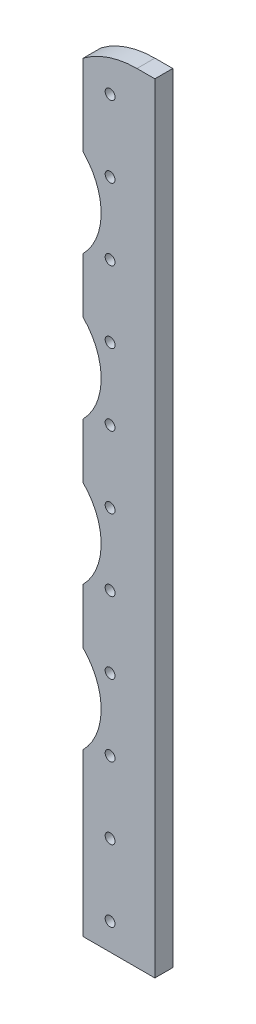
ISO-10303-21;
HEADER;
FILE_DESCRIPTION(('STEP AP214'),'2;1');
FILE_NAME('part.step','',(''),(''),'','','');
FILE_SCHEMA(('AUTOMOTIVE_DESIGN { 1 0 10303 214 1 1 1 1 }'));
ENDSEC;
DATA;
#1=APPLICATION_CONTEXT('core data for automotive mechanical design processes');
#2=APPLICATION_PROTOCOL_DEFINITION('international standard','automotive_design',2000,#1);
#3=PRODUCT_CONTEXT('',#1,'mechanical');
#4=PRODUCT('Part','Part','',(#3));
#5=PRODUCT_RELATED_PRODUCT_CATEGORY('part','',(#4));
#6=PRODUCT_DEFINITION_FORMATION('','',#4);
#7=PRODUCT_DEFINITION_CONTEXT('part definition',#1,'design');
#8=PRODUCT_DEFINITION('design','',#6,#7);
#9=PRODUCT_DEFINITION_SHAPE('','',#8);
#10=(LENGTH_UNIT() NAMED_UNIT(*) SI_UNIT(.MILLI.,.METRE.));
#11=(NAMED_UNIT(*) PLANE_ANGLE_UNIT() SI_UNIT($,.RADIAN.));
#12=(NAMED_UNIT(*) SI_UNIT($,.STERADIAN.) SOLID_ANGLE_UNIT());
#13=UNCERTAINTY_MEASURE_WITH_UNIT(LENGTH_MEASURE(1.E-05),#10,'distance_accuracy_value','');
#14=(GEOMETRIC_REPRESENTATION_CONTEXT(3) GLOBAL_UNCERTAINTY_ASSIGNED_CONTEXT((#13)) GLOBAL_UNIT_ASSIGNED_CONTEXT((#10,
#11,#12)) REPRESENTATION_CONTEXT('',''));
#15=CARTESIAN_POINT('',(0.,0.,0.));
#16=DIRECTION('',(0.,0.,1.));
#17=DIRECTION('',(1.,0.,0.));
#18=AXIS2_PLACEMENT_3D('',#15,#16,#17);
#19=CARTESIAN_POINT('',(-25.4,0.,6.35));
#20=DIRECTION('',(1.,0.,0.));
#21=DIRECTION('',(0.,0.,-1.));
#22=AXIS2_PLACEMENT_3D('',#19,#20,#21);
#23=PLANE('',#22);
#24=DIRECTION('',(0.,-1.,0.));
#25=VECTOR('',#24,1.);
#26=CARTESIAN_POINT('',(-25.4,0.,0.));
#27=LINE('',#26,#25);
#28=CARTESIAN_POINT('',(-25.4,108.270740133327,0.));
#29=VERTEX_POINT('',#28);
#30=CARTESIAN_POINT('',(-25.4,88.5792598666732,0.));
#31=VERTEX_POINT('',#30);
#32=EDGE_CURVE('E148',#29,#31,#27,.T.);
#33=ORIENTED_EDGE('',*,*,#32,.T.);
#34=DIRECTION('',(0.,0.,1.));
#35=VECTOR('',#34,1.);
#36=CARTESIAN_POINT('',(-25.4,88.5792598666732,0.));
#37=LINE('',#36,#35);
#38=CARTESIAN_POINT('',(-25.4,88.5792598666732,6.35));
#39=VERTEX_POINT('',#38);
#40=EDGE_CURVE('E50',#31,#39,#37,.T.);
#41=ORIENTED_EDGE('',*,*,#40,.T.);
#42=DIRECTION('',(0.,-1.,0.));
#43=VECTOR('',#42,1.);
#44=CARTESIAN_POINT('',(-25.4,0.,6.35));
#45=LINE('',#44,#43);
#46=CARTESIAN_POINT('',(-25.4,108.270740133327,6.35));
#47=VERTEX_POINT('',#46);
#48=EDGE_CURVE('E274',#47,#39,#45,.T.);
#49=ORIENTED_EDGE('',*,*,#48,.F.);
#50=DIRECTION('',(0.,0.,1.));
#51=VECTOR('',#50,1.);
#52=CARTESIAN_POINT('',(-25.4,108.270740133327,0.));
#53=LINE('',#52,#51);
#54=EDGE_CURVE('E548',#47,#29,#53,.F.);
#55=ORIENTED_EDGE('',*,*,#54,.T.);
#56=EDGE_LOOP('',(#33,#41,#49,#55));
#57=FACE_BOUND('',#56,.T.);
#58=ADVANCED_FACE('F35',(#57),#23,.F.);
#59=CARTESIAN_POINT('',(-25.4,159.070740133327,0.));
#60=VERTEX_POINT('',#59);
#61=CARTESIAN_POINT('',(-25.4,139.379259866673,0.));
#62=VERTEX_POINT('',#61);
#63=EDGE_CURVE('E152',#60,#62,#27,.T.);
#64=ORIENTED_EDGE('',*,*,#63,.T.);
#65=DIRECTION('',(0.,0.,1.));
#66=VECTOR('',#65,1.);
#67=CARTESIAN_POINT('',(-25.4,139.379259866673,0.));
#68=LINE('',#67,#66);
#69=CARTESIAN_POINT('',(-25.4,139.379259866673,6.35));
#70=VERTEX_POINT('',#69);
#71=EDGE_CURVE('E57',#62,#70,#68,.T.);
#72=ORIENTED_EDGE('',*,*,#71,.T.);
#73=CARTESIAN_POINT('',(-25.4,159.070740133327,6.35));
#74=VERTEX_POINT('',#73);
#75=EDGE_CURVE('E276',#74,#70,#45,.T.);
#76=ORIENTED_EDGE('',*,*,#75,.F.);
#77=DIRECTION('',(0.,0.,1.));
#78=VECTOR('',#77,1.);
#79=CARTESIAN_POINT('',(-25.4,159.070740133327,0.));
#80=LINE('',#79,#78);
#81=EDGE_CURVE('E176',#74,#60,#80,.F.);
#82=ORIENTED_EDGE('',*,*,#81,.T.);
#83=EDGE_LOOP('',(#64,#72,#76,#82));
#84=FACE_BOUND('',#83,.T.);
#85=ADVANCED_FACE('F173',(#84),#23,.F.);
#86=CARTESIAN_POINT('',(-25.4,209.870740133327,0.));
#87=VERTEX_POINT('',#86);
#88=CARTESIAN_POINT('',(-25.4,190.179259866673,0.));
#89=VERTEX_POINT('',#88);
#90=EDGE_CURVE('E158',#87,#89,#27,.T.);
#91=ORIENTED_EDGE('',*,*,#90,.T.);
#92=DIRECTION('',(0.,0.,1.));
#93=VECTOR('',#92,1.);
#94=CARTESIAN_POINT('',(-25.4,190.179259866673,0.));
#95=LINE('',#94,#93);
#96=CARTESIAN_POINT('',(-25.4,190.179259866673,6.35));
#97=VERTEX_POINT('',#96);
#98=EDGE_CURVE('E289',#89,#97,#95,.T.);
#99=ORIENTED_EDGE('',*,*,#98,.T.);
#100=CARTESIAN_POINT('',(-25.4,209.870740133327,6.35));
#101=VERTEX_POINT('',#100);
#102=EDGE_CURVE('E257',#101,#97,#45,.T.);
#103=ORIENTED_EDGE('',*,*,#102,.F.);
#104=DIRECTION('',(0.,0.,1.));
#105=VECTOR('',#104,1.);
#106=CARTESIAN_POINT('',(-25.4,209.870740133327,0.));
#107=LINE('',#106,#105);
#108=EDGE_CURVE('E288',#101,#87,#107,.F.);
#109=ORIENTED_EDGE('',*,*,#108,.T.);
#110=EDGE_LOOP('',(#91,#99,#103,#109));
#111=FACE_BOUND('',#110,.T.);
#112=ADVANCED_FACE('F287',(#111),#23,.F.);
#113=CARTESIAN_POINT('',(-25.4,269.875,0.));
#114=VERTEX_POINT('',#113);
#115=CARTESIAN_POINT('',(-25.4,240.979259866673,0.));
#116=VERTEX_POINT('',#115);
#117=EDGE_CURVE('E151',#114,#116,#27,.T.);
#118=ORIENTED_EDGE('',*,*,#117,.T.);
#119=DIRECTION('',(0.,0.,1.));
#120=VECTOR('',#119,1.);
#121=CARTESIAN_POINT('',(-25.4,240.979259866673,0.));
#122=LINE('',#121,#120);
#123=CARTESIAN_POINT('',(-25.4,240.979259866673,6.35));
#124=VERTEX_POINT('',#123);
#125=EDGE_CURVE('E297',#116,#124,#122,.T.);
#126=ORIENTED_EDGE('',*,*,#125,.T.);
#127=CARTESIAN_POINT('',(-25.4,269.875,6.35));
#128=VERTEX_POINT('',#127);
#129=EDGE_CURVE('E251',#128,#124,#45,.T.);
#130=ORIENTED_EDGE('',*,*,#129,.F.);
#131=DIRECTION('',(0.,0.,1.));
#132=VECTOR('',#131,1.);
#133=CARTESIAN_POINT('',(-25.4,269.875,0.));
#134=LINE('',#133,#132);
#135=EDGE_CURVE('E261',#114,#128,#134,.T.);
#136=ORIENTED_EDGE('',*,*,#135,.F.);
#137=EDGE_LOOP('',(#118,#126,#130,#136));
#138=FACE_BOUND('',#137,.T.);
#139=ADVANCED_FACE('F313',(#138),#23,.F.);
#140=CARTESIAN_POINT('',(-25.4,57.4707401333268,6.35));
#141=VERTEX_POINT('',#140);
#142=CARTESIAN_POINT('',(-25.4,0.,6.35));
#143=VERTEX_POINT('',#142);
#144=EDGE_CURVE('E140',#141,#143,#45,.T.);
#145=ORIENTED_EDGE('',*,*,#144,.F.);
#146=DIRECTION('',(0.,0.,1.));
#147=VECTOR('',#146,1.);
#148=CARTESIAN_POINT('',(-25.4,57.4707401333268,0.));
#149=LINE('',#148,#147);
#150=CARTESIAN_POINT('',(-25.4,57.4707401333268,0.));
#151=VERTEX_POINT('',#150);
#152=EDGE_CURVE('E128',#141,#151,#149,.F.);
#153=ORIENTED_EDGE('',*,*,#152,.T.);
#154=CARTESIAN_POINT('',(-25.4,0.,0.));
#155=VERTEX_POINT('',#154);
#156=EDGE_CURVE('E138',#151,#155,#27,.T.);
#157=ORIENTED_EDGE('',*,*,#156,.T.);
#158=DIRECTION('',(0.,0.,-1.));
#159=VECTOR('',#158,1.);
#160=CARTESIAN_POINT('',(-25.4,0.,6.35));
#161=LINE('',#160,#159);
#162=EDGE_CURVE('E242',#143,#155,#161,.T.);
#163=ORIENTED_EDGE('',*,*,#162,.F.);
#164=EDGE_LOOP('',(#145,#153,#157,#163));
#165=FACE_BOUND('',#164,.T.);
#166=ADVANCED_FACE('F136',(#165),#23,.F.);
#167=CARTESIAN_POINT('',(0.,0.,6.35));
#168=DIRECTION('',(0.,0.,1.));
#169=DIRECTION('',(1.,0.,0.));
#170=AXIS2_PLACEMENT_3D('',#167,#168,#169);
#171=PLANE('',#170);
#172=CARTESIAN_POINT('',(-41.275,73.025,6.35));
#173=DIRECTION('',(0.,0.,1.));
#174=DIRECTION('',(1.,0.,0.));
#175=AXIS2_PLACEMENT_3D('',#172,#173,#174);
#176=CIRCLE('',#175,22.225);
#177=EDGE_CURVE('E141',#141,#39,#176,.T.);
#178=ORIENTED_EDGE('',*,*,#177,.F.);
#179=ORIENTED_EDGE('',*,*,#144,.T.);
#180=DIRECTION('',(1.,0.,0.));
#181=VECTOR('',#180,1.);
#182=CARTESIAN_POINT('',(0.,0.,6.35));
#183=LINE('',#182,#181);
#184=CARTESIAN_POINT('',(0.,0.,6.35));
#185=VERTEX_POINT('',#184);
#186=EDGE_CURVE('E246',#143,#185,#183,.T.);
#187=ORIENTED_EDGE('',*,*,#186,.T.);
#188=DIRECTION('',(0.,1.,0.));
#189=VECTOR('',#188,1.);
#190=CARTESIAN_POINT('',(0.,0.,6.35));
#191=LINE('',#190,#189);
#192=CARTESIAN_POINT('',(0.,276.225,6.35));
#193=VERTEX_POINT('',#192);
#194=EDGE_CURVE('E163',#185,#193,#191,.T.);
#195=ORIENTED_EDGE('',*,*,#194,.T.);
#196=DIRECTION('',(-1.,0.,0.));
#197=VECTOR('',#196,1.);
#198=CARTESIAN_POINT('',(0.,276.225,6.35));
#199=LINE('',#198,#197);
#200=CARTESIAN_POINT('',(-6.35,276.225,6.35));
#201=VERTEX_POINT('',#200);
#202=EDGE_CURVE('E272',#193,#201,#199,.T.);
#203=ORIENTED_EDGE('',*,*,#202,.T.);
#204=CARTESIAN_POINT('',(-6.35,244.475,6.35));
#205=DIRECTION('',(0.,0.,1.));
#206=DIRECTION('',(1.,0.,0.));
#207=AXIS2_PLACEMENT_3D('',#204,#205,#206);
#208=CIRCLE('',#207,31.75);
#209=EDGE_CURVE('E309',#201,#128,#208,.T.);
#210=ORIENTED_EDGE('',*,*,#209,.T.);
#211=ORIENTED_EDGE('',*,*,#129,.T.);
#212=CARTESIAN_POINT('',(-41.275,225.425,6.35));
#213=DIRECTION('',(0.,0.,1.));
#214=DIRECTION('',(1.,0.,0.));
#215=AXIS2_PLACEMENT_3D('',#212,#213,#214);
#216=CIRCLE('',#215,22.225);
#217=EDGE_CURVE('E286',#101,#124,#216,.T.);
#218=ORIENTED_EDGE('',*,*,#217,.F.);
#219=ORIENTED_EDGE('',*,*,#102,.T.);
#220=CARTESIAN_POINT('',(-41.275,174.625,6.35));
#221=DIRECTION('',(0.,0.,1.));
#222=DIRECTION('',(1.,0.,0.));
#223=AXIS2_PLACEMENT_3D('',#220,#221,#222);
#224=CIRCLE('',#223,22.225);
#225=EDGE_CURVE('E285',#74,#97,#224,.T.);
#226=ORIENTED_EDGE('',*,*,#225,.F.);
#227=ORIENTED_EDGE('',*,*,#75,.T.);
#228=CARTESIAN_POINT('',(-41.275,123.825,6.35));
#229=DIRECTION('',(0.,0.,1.));
#230=DIRECTION('',(1.,0.,0.));
#231=AXIS2_PLACEMENT_3D('',#228,#229,#230);
#232=CIRCLE('',#231,22.225);
#233=EDGE_CURVE('E552',#47,#70,#232,.T.);
#234=ORIENTED_EDGE('',*,*,#233,.F.);
#235=ORIENTED_EDGE('',*,*,#48,.T.);
#236=EDGE_LOOP('',(#178,#179,#187,#195,#203,#210,#211,#218,#219,#226,#227,#234,#235));
#237=FACE_BOUND('',#236,.T.);
#238=CARTESIAN_POINT('',(-15.875,238.125,6.35));
#239=DIRECTION('',(0.,0.,1.));
#240=DIRECTION('',(1.,0.,0.));
#241=AXIS2_PLACEMENT_3D('',#238,#239,#240);
#242=CIRCLE('',#241,1.75);
#243=CARTESIAN_POINT('',(-14.125,238.125,6.35));
#244=VERTEX_POINT('',#243);
#245=EDGE_CURVE('E302',#244,#244,#242,.T.);
#246=ORIENTED_EDGE('',*,*,#245,.F.);
#247=EDGE_LOOP('',(#246));
#248=FACE_BOUND('',#247,.T.);
#249=CARTESIAN_POINT('',(-15.875,263.525,6.35));
#250=DIRECTION('',(0.,0.,1.));
#251=DIRECTION('',(1.,0.,0.));
#252=AXIS2_PLACEMENT_3D('',#249,#250,#251);
#253=CIRCLE('',#252,1.75);
#254=CARTESIAN_POINT('',(-14.125,263.525,6.35));
#255=VERTEX_POINT('',#254);
#256=EDGE_CURVE('E305',#255,#255,#253,.T.);
#257=ORIENTED_EDGE('',*,*,#256,.F.);
#258=EDGE_LOOP('',(#257));
#259=FACE_BOUND('',#258,.T.);
#260=CARTESIAN_POINT('',(-15.875,212.725,6.35));
#261=DIRECTION('',(0.,0.,1.));
#262=DIRECTION('',(1.,0.,0.));
#263=AXIS2_PLACEMENT_3D('',#260,#261,#262);
#264=CIRCLE('',#263,1.75);
#265=CARTESIAN_POINT('',(-14.125,212.725,6.35));
#266=VERTEX_POINT('',#265);
#267=EDGE_CURVE('E233',#266,#266,#264,.T.);
#268=ORIENTED_EDGE('',*,*,#267,.F.);
#269=EDGE_LOOP('',(#268));
#270=FACE_BOUND('',#269,.T.);
#271=CARTESIAN_POINT('',(-15.875,187.325,6.35));
#272=DIRECTION('',(0.,0.,1.));
#273=DIRECTION('',(1.,0.,0.));
#274=AXIS2_PLACEMENT_3D('',#271,#272,#273);
#275=CIRCLE('',#274,1.75);
#276=CARTESIAN_POINT('',(-14.125,187.325,6.35));
#277=VERTEX_POINT('',#276);
#278=EDGE_CURVE('E227',#277,#277,#275,.T.);
#279=ORIENTED_EDGE('',*,*,#278,.F.);
#280=EDGE_LOOP('',(#279));
#281=FACE_BOUND('',#280,.T.);
#282=CARTESIAN_POINT('',(-15.875,161.925,6.35));
#283=DIRECTION('',(0.,0.,1.));
#284=DIRECTION('',(1.,0.,0.));
#285=AXIS2_PLACEMENT_3D('',#282,#283,#284);
#286=CIRCLE('',#285,1.75);
#287=CARTESIAN_POINT('',(-14.125,161.925,6.35));
#288=VERTEX_POINT('',#287);
#289=EDGE_CURVE('E221',#288,#288,#286,.T.);
#290=ORIENTED_EDGE('',*,*,#289,.F.);
#291=EDGE_LOOP('',(#290));
#292=FACE_BOUND('',#291,.T.);
#293=CARTESIAN_POINT('',(-15.875,136.525,6.35));
#294=DIRECTION('',(0.,0.,1.));
#295=DIRECTION('',(1.,0.,0.));
#296=AXIS2_PLACEMENT_3D('',#293,#294,#295);
#297=CIRCLE('',#296,1.75);
#298=CARTESIAN_POINT('',(-14.125,136.525,6.35));
#299=VERTEX_POINT('',#298);
#300=EDGE_CURVE('E215',#299,#299,#297,.T.);
#301=ORIENTED_EDGE('',*,*,#300,.F.);
#302=EDGE_LOOP('',(#301));
#303=FACE_BOUND('',#302,.T.);
#304=CARTESIAN_POINT('',(-15.875,111.125,6.35));
#305=DIRECTION('',(0.,0.,1.));
#306=DIRECTION('',(1.,0.,0.));
#307=AXIS2_PLACEMENT_3D('',#304,#305,#306);
#308=CIRCLE('',#307,1.75);
#309=CARTESIAN_POINT('',(-14.125,111.125,6.35));
#310=VERTEX_POINT('',#309);
#311=EDGE_CURVE('E209',#310,#310,#308,.T.);
#312=ORIENTED_EDGE('',*,*,#311,.F.);
#313=EDGE_LOOP('',(#312));
#314=FACE_BOUND('',#313,.T.);
#315=CARTESIAN_POINT('',(-15.875,85.725,6.35));
#316=DIRECTION('',(0.,0.,1.));
#317=DIRECTION('',(1.,0.,0.));
#318=AXIS2_PLACEMENT_3D('',#315,#316,#317);
#319=CIRCLE('',#318,1.75);
#320=CARTESIAN_POINT('',(-14.125,85.725,6.35));
#321=VERTEX_POINT('',#320);
#322=EDGE_CURVE('E203',#321,#321,#319,.T.);
#323=ORIENTED_EDGE('',*,*,#322,.F.);
#324=EDGE_LOOP('',(#323));
#325=FACE_BOUND('',#324,.T.);
#326=CARTESIAN_POINT('',(-15.875,60.325,6.35));
#327=DIRECTION('',(0.,0.,1.));
#328=DIRECTION('',(1.,0.,0.));
#329=AXIS2_PLACEMENT_3D('',#326,#327,#328);
#330=CIRCLE('',#329,1.75);
#331=CARTESIAN_POINT('',(-14.125,60.325,6.35));
#332=VERTEX_POINT('',#331);
#333=EDGE_CURVE('E197',#332,#332,#330,.T.);
#334=ORIENTED_EDGE('',*,*,#333,.F.);
#335=EDGE_LOOP('',(#334));
#336=FACE_BOUND('',#335,.T.);
#337=CARTESIAN_POINT('',(-15.875,34.925,6.35));
#338=DIRECTION('',(0.,0.,1.));
#339=DIRECTION('',(1.,0.,0.));
#340=AXIS2_PLACEMENT_3D('',#337,#338,#339);
#341=CIRCLE('',#340,1.75);
#342=CARTESIAN_POINT('',(-14.125,34.925,6.35));
#343=VERTEX_POINT('',#342);
#344=EDGE_CURVE('E191',#343,#343,#341,.T.);
#345=ORIENTED_EDGE('',*,*,#344,.F.);
#346=EDGE_LOOP('',(#345));
#347=FACE_BOUND('',#346,.T.);
#348=CARTESIAN_POINT('',(-15.875,9.52500000000001,6.35));
#349=DIRECTION('',(0.,0.,1.));
#350=DIRECTION('',(1.,0.,0.));
#351=AXIS2_PLACEMENT_3D('',#348,#349,#350);
#352=CIRCLE('',#351,1.75);
#353=CARTESIAN_POINT('',(-14.125,9.52500000000001,6.35));
#354=VERTEX_POINT('',#353);
#355=EDGE_CURVE('E185',#354,#354,#352,.T.);
#356=ORIENTED_EDGE('',*,*,#355,.F.);
#357=EDGE_LOOP('',(#356));
#358=FACE_BOUND('',#357,.T.);
#359=ADVANCED_FACE('F283',(#237,#248,#259,#270,#281,#292,#303,#314,#325,#336,#347,#358),#171,.T.);
#360=CARTESIAN_POINT('',(0.,0.,0.));
#361=DIRECTION('',(0.,0.,1.));
#362=DIRECTION('',(1.,0.,0.));
#363=AXIS2_PLACEMENT_3D('',#360,#361,#362);
#364=PLANE('',#363);
#365=CARTESIAN_POINT('',(-15.875,238.125,0.));
#366=DIRECTION('',(0.,0.,1.));
#367=DIRECTION('',(1.,0.,0.));
#368=AXIS2_PLACEMENT_3D('',#365,#366,#367);
#369=CIRCLE('',#368,1.75);
#370=CARTESIAN_POINT('',(-14.125,238.125,0.));
#371=VERTEX_POINT('',#370);
#372=EDGE_CURVE('E299',#371,#371,#369,.T.);
#373=ORIENTED_EDGE('',*,*,#372,.T.);
#374=EDGE_LOOP('',(#373));
#375=FACE_BOUND('',#374,.T.);
#376=CARTESIAN_POINT('',(-15.875,263.525,0.));
#377=DIRECTION('',(0.,0.,1.));
#378=DIRECTION('',(1.,0.,0.));
#379=AXIS2_PLACEMENT_3D('',#376,#377,#378);
#380=CIRCLE('',#379,1.75);
#381=CARTESIAN_POINT('',(-14.125,263.525,0.));
#382=VERTEX_POINT('',#381);
#383=EDGE_CURVE('E306',#382,#382,#380,.T.);
#384=ORIENTED_EDGE('',*,*,#383,.T.);
#385=EDGE_LOOP('',(#384));
#386=FACE_BOUND('',#385,.T.);
#387=ORIENTED_EDGE('',*,*,#156,.F.);
#388=CARTESIAN_POINT('',(-41.275,73.025,0.));
#389=DIRECTION('',(0.,0.,1.));
#390=DIRECTION('',(1.,0.,0.));
#391=AXIS2_PLACEMENT_3D('',#388,#389,#390);
#392=CIRCLE('',#391,22.225);
#393=EDGE_CURVE('E11',#151,#31,#392,.T.);
#394=ORIENTED_EDGE('',*,*,#393,.T.);
#395=ORIENTED_EDGE('',*,*,#32,.F.);
#396=CARTESIAN_POINT('',(-41.275,123.825,0.));
#397=DIRECTION('',(0.,0.,1.));
#398=DIRECTION('',(1.,0.,0.));
#399=AXIS2_PLACEMENT_3D('',#396,#397,#398);
#400=CIRCLE('',#399,22.225);
#401=EDGE_CURVE('E43',#29,#62,#400,.T.);
#402=ORIENTED_EDGE('',*,*,#401,.T.);
#403=ORIENTED_EDGE('',*,*,#63,.F.);
#404=CARTESIAN_POINT('',(-41.275,174.625,0.));
#405=DIRECTION('',(0.,0.,1.));
#406=DIRECTION('',(1.,0.,0.));
#407=AXIS2_PLACEMENT_3D('',#404,#405,#406);
#408=CIRCLE('',#407,22.225);
#409=EDGE_CURVE('E178',#60,#89,#408,.T.);
#410=ORIENTED_EDGE('',*,*,#409,.T.);
#411=ORIENTED_EDGE('',*,*,#90,.F.);
#412=CARTESIAN_POINT('',(-41.275,225.425,0.));
#413=DIRECTION('',(0.,0.,1.));
#414=DIRECTION('',(1.,0.,0.));
#415=AXIS2_PLACEMENT_3D('',#412,#413,#414);
#416=CIRCLE('',#415,22.225);
#417=EDGE_CURVE('E180',#87,#116,#416,.T.);
#418=ORIENTED_EDGE('',*,*,#417,.T.);
#419=ORIENTED_EDGE('',*,*,#117,.F.);
#420=CARTESIAN_POINT('',(-6.35,244.475,0.));
#421=DIRECTION('',(0.,0.,1.));
#422=DIRECTION('',(1.,0.,0.));
#423=AXIS2_PLACEMENT_3D('',#420,#421,#422);
#424=CIRCLE('',#423,31.75);
#425=CARTESIAN_POINT('',(-6.35,276.225,0.));
#426=VERTEX_POINT('',#425);
#427=EDGE_CURVE('E268',#426,#114,#424,.T.);
#428=ORIENTED_EDGE('',*,*,#427,.F.);
#429=DIRECTION('',(-1.,0.,0.));
#430=VECTOR('',#429,1.);
#431=CARTESIAN_POINT('',(0.,276.225,0.));
#432=LINE('',#431,#430);
#433=CARTESIAN_POINT('',(0.,276.225,0.));
#434=VERTEX_POINT('',#433);
#435=EDGE_CURVE('E149',#434,#426,#432,.T.);
#436=ORIENTED_EDGE('',*,*,#435,.F.);
#437=DIRECTION('',(0.,1.,0.));
#438=VECTOR('',#437,1.);
#439=CARTESIAN_POINT('',(0.,0.,0.));
#440=LINE('',#439,#438);
#441=CARTESIAN_POINT('',(0.,0.,0.));
#442=VERTEX_POINT('',#441);
#443=EDGE_CURVE('E154',#442,#434,#440,.T.);
#444=ORIENTED_EDGE('',*,*,#443,.F.);
#445=DIRECTION('',(1.,0.,0.));
#446=VECTOR('',#445,1.);
#447=CARTESIAN_POINT('',(0.,0.,0.));
#448=LINE('',#447,#446);
#449=EDGE_CURVE('E147',#155,#442,#448,.T.);
#450=ORIENTED_EDGE('',*,*,#449,.F.);
#451=EDGE_LOOP('',(#387,#394,#395,#402,#403,#410,#411,#418,#419,#428,#436,#444,#450));
#452=FACE_BOUND('',#451,.T.);
#453=CARTESIAN_POINT('',(-15.875,212.725,0.));
#454=DIRECTION('',(0.,0.,1.));
#455=DIRECTION('',(1.,0.,0.));
#456=AXIS2_PLACEMENT_3D('',#453,#454,#455);
#457=CIRCLE('',#456,1.75);
#458=CARTESIAN_POINT('',(-14.125,212.725,0.));
#459=VERTEX_POINT('',#458);
#460=EDGE_CURVE('E236',#459,#459,#457,.T.);
#461=ORIENTED_EDGE('',*,*,#460,.T.);
#462=EDGE_LOOP('',(#461));
#463=FACE_BOUND('',#462,.T.);
#464=CARTESIAN_POINT('',(-15.875,187.325,0.));
#465=DIRECTION('',(0.,0.,1.));
#466=DIRECTION('',(1.,0.,0.));
#467=AXIS2_PLACEMENT_3D('',#464,#465,#466);
#468=CIRCLE('',#467,1.75);
#469=CARTESIAN_POINT('',(-14.125,187.325,0.));
#470=VERTEX_POINT('',#469);
#471=EDGE_CURVE('E230',#470,#470,#468,.T.);
#472=ORIENTED_EDGE('',*,*,#471,.T.);
#473=EDGE_LOOP('',(#472));
#474=FACE_BOUND('',#473,.T.);
#475=CARTESIAN_POINT('',(-15.875,161.925,0.));
#476=DIRECTION('',(0.,0.,1.));
#477=DIRECTION('',(1.,0.,0.));
#478=AXIS2_PLACEMENT_3D('',#475,#476,#477);
#479=CIRCLE('',#478,1.75);
#480=CARTESIAN_POINT('',(-14.125,161.925,0.));
#481=VERTEX_POINT('',#480);
#482=EDGE_CURVE('E224',#481,#481,#479,.T.);
#483=ORIENTED_EDGE('',*,*,#482,.T.);
#484=EDGE_LOOP('',(#483));
#485=FACE_BOUND('',#484,.T.);
#486=CARTESIAN_POINT('',(-15.875,136.525,0.));
#487=DIRECTION('',(0.,0.,1.));
#488=DIRECTION('',(1.,0.,0.));
#489=AXIS2_PLACEMENT_3D('',#486,#487,#488);
#490=CIRCLE('',#489,1.75);
#491=CARTESIAN_POINT('',(-14.125,136.525,0.));
#492=VERTEX_POINT('',#491);
#493=EDGE_CURVE('E218',#492,#492,#490,.T.);
#494=ORIENTED_EDGE('',*,*,#493,.T.);
#495=EDGE_LOOP('',(#494));
#496=FACE_BOUND('',#495,.T.);
#497=CARTESIAN_POINT('',(-15.875,111.125,0.));
#498=DIRECTION('',(0.,0.,1.));
#499=DIRECTION('',(1.,0.,0.));
#500=AXIS2_PLACEMENT_3D('',#497,#498,#499);
#501=CIRCLE('',#500,1.75);
#502=CARTESIAN_POINT('',(-14.125,111.125,0.));
#503=VERTEX_POINT('',#502);
#504=EDGE_CURVE('E212',#503,#503,#501,.T.);
#505=ORIENTED_EDGE('',*,*,#504,.T.);
#506=EDGE_LOOP('',(#505));
#507=FACE_BOUND('',#506,.T.);
#508=CARTESIAN_POINT('',(-15.875,85.725,0.));
#509=DIRECTION('',(0.,0.,1.));
#510=DIRECTION('',(1.,0.,0.));
#511=AXIS2_PLACEMENT_3D('',#508,#509,#510);
#512=CIRCLE('',#511,1.75);
#513=CARTESIAN_POINT('',(-14.125,85.725,0.));
#514=VERTEX_POINT('',#513);
#515=EDGE_CURVE('E206',#514,#514,#512,.T.);
#516=ORIENTED_EDGE('',*,*,#515,.T.);
#517=EDGE_LOOP('',(#516));
#518=FACE_BOUND('',#517,.T.);
#519=CARTESIAN_POINT('',(-15.875,60.325,0.));
#520=DIRECTION('',(0.,0.,1.));
#521=DIRECTION('',(1.,0.,0.));
#522=AXIS2_PLACEMENT_3D('',#519,#520,#521);
#523=CIRCLE('',#522,1.75);
#524=CARTESIAN_POINT('',(-14.125,60.325,0.));
#525=VERTEX_POINT('',#524);
#526=EDGE_CURVE('E200',#525,#525,#523,.T.);
#527=ORIENTED_EDGE('',*,*,#526,.T.);
#528=EDGE_LOOP('',(#527));
#529=FACE_BOUND('',#528,.T.);
#530=CARTESIAN_POINT('',(-15.875,34.925,0.));
#531=DIRECTION('',(0.,0.,1.));
#532=DIRECTION('',(1.,0.,0.));
#533=AXIS2_PLACEMENT_3D('',#530,#531,#532);
#534=CIRCLE('',#533,1.75);
#535=CARTESIAN_POINT('',(-14.125,34.925,0.));
#536=VERTEX_POINT('',#535);
#537=EDGE_CURVE('E194',#536,#536,#534,.T.);
#538=ORIENTED_EDGE('',*,*,#537,.T.);
#539=EDGE_LOOP('',(#538));
#540=FACE_BOUND('',#539,.T.);
#541=CARTESIAN_POINT('',(-15.875,9.52500000000001,0.));
#542=DIRECTION('',(0.,0.,1.));
#543=DIRECTION('',(1.,0.,0.));
#544=AXIS2_PLACEMENT_3D('',#541,#542,#543);
#545=CIRCLE('',#544,1.75);
#546=CARTESIAN_POINT('',(-14.125,9.52500000000001,0.));
#547=VERTEX_POINT('',#546);
#548=EDGE_CURVE('E188',#547,#547,#545,.T.);
#549=ORIENTED_EDGE('',*,*,#548,.T.);
#550=EDGE_LOOP('',(#549));
#551=FACE_BOUND('',#550,.T.);
#552=ADVANCED_FACE('F144',(#375,#386,#452,#463,#474,#485,#496,#507,#518,#529,#540,#551),#364,.F.);
#553=CARTESIAN_POINT('',(0.,0.,6.35));
#554=DIRECTION('',(-1.,0.,0.));
#555=DIRECTION('',(0.,0.,1.));
#556=AXIS2_PLACEMENT_3D('',#553,#554,#555);
#557=PLANE('',#556);
#558=ORIENTED_EDGE('',*,*,#443,.T.);
#559=DIRECTION('',(0.,0.,-1.));
#560=VECTOR('',#559,1.);
#561=CARTESIAN_POINT('',(0.,276.225,6.35));
#562=LINE('',#561,#560);
#563=EDGE_CURVE('E239',#193,#434,#562,.T.);
#564=ORIENTED_EDGE('',*,*,#563,.F.);
#565=ORIENTED_EDGE('',*,*,#194,.F.);
#566=DIRECTION('',(0.,0.,-1.));
#567=VECTOR('',#566,1.);
#568=CARTESIAN_POINT('',(0.,0.,6.35));
#569=LINE('',#568,#567);
#570=EDGE_CURVE('E244',#185,#442,#569,.T.);
#571=ORIENTED_EDGE('',*,*,#570,.T.);
#572=EDGE_LOOP('',(#558,#564,#565,#571));
#573=FACE_BOUND('',#572,.T.);
#574=ADVANCED_FACE('F319',(#573),#557,.F.);
#575=CARTESIAN_POINT('',(0.,276.225,6.35));
#576=DIRECTION('',(0.,-1.,0.));
#577=DIRECTION('',(0.,0.,-1.));
#578=AXIS2_PLACEMENT_3D('',#575,#576,#577);
#579=PLANE('',#578);
#580=ORIENTED_EDGE('',*,*,#435,.T.);
#581=DIRECTION('',(0.,0.,1.));
#582=VECTOR('',#581,1.);
#583=CARTESIAN_POINT('',(-6.35,276.225,0.));
#584=LINE('',#583,#582);
#585=EDGE_CURVE('E263',#426,#201,#584,.T.);
#586=ORIENTED_EDGE('',*,*,#585,.T.);
#587=ORIENTED_EDGE('',*,*,#202,.F.);
#588=ORIENTED_EDGE('',*,*,#563,.T.);
#589=EDGE_LOOP('',(#580,#586,#587,#588));
#590=FACE_BOUND('',#589,.T.);
#591=ADVANCED_FACE('F318',(#590),#579,.F.);
#592=CARTESIAN_POINT('',(0.,0.,6.35));
#593=DIRECTION('',(0.,1.,0.));
#594=DIRECTION('',(-1.,0.,0.));
#595=AXIS2_PLACEMENT_3D('',#592,#593,#594);
#596=PLANE('',#595);
#597=ORIENTED_EDGE('',*,*,#449,.T.);
#598=ORIENTED_EDGE('',*,*,#570,.F.);
#599=ORIENTED_EDGE('',*,*,#186,.F.);
#600=ORIENTED_EDGE('',*,*,#162,.T.);
#601=EDGE_LOOP('',(#597,#598,#599,#600));
#602=FACE_BOUND('',#601,.T.);
#603=ADVANCED_FACE('F326',(#602),#596,.F.);
#604=CARTESIAN_POINT('',(-6.35,244.475,0.));
#605=DIRECTION('',(0.,0.,1.));
#606=DIRECTION('',(1.,0.,0.));
#607=AXIS2_PLACEMENT_3D('',#604,#605,#606);
#608=CYLINDRICAL_SURFACE('',#607,31.75);
#609=ORIENTED_EDGE('',*,*,#135,.T.);
#610=ORIENTED_EDGE('',*,*,#209,.F.);
#611=ORIENTED_EDGE('',*,*,#585,.F.);
#612=ORIENTED_EDGE('',*,*,#427,.T.);
#613=EDGE_LOOP('',(#609,#610,#611,#612));
#614=FACE_BOUND('',#613,.T.);
#615=ADVANCED_FACE('F478',(#614),#608,.T.);
#616=CARTESIAN_POINT('',(-15.875,263.525,0.));
#617=DIRECTION('',(0.,0.,1.));
#618=DIRECTION('',(1.,0.,0.));
#619=AXIS2_PLACEMENT_3D('',#616,#617,#618);
#620=CYLINDRICAL_SURFACE('',#619,1.75);
#621=ORIENTED_EDGE('',*,*,#383,.F.);
#622=EDGE_LOOP('',(#621));
#623=FACE_BOUND('',#622,.T.);
#624=ORIENTED_EDGE('',*,*,#256,.T.);
#625=EDGE_LOOP('',(#624));
#626=FACE_BOUND('',#625,.T.);
#627=ADVANCED_FACE('F468',(#623,#626),#620,.F.);
#628=CARTESIAN_POINT('',(-15.875,238.125,0.));
#629=DIRECTION('',(0.,0.,1.));
#630=DIRECTION('',(1.,0.,0.));
#631=AXIS2_PLACEMENT_3D('',#628,#629,#630);
#632=CYLINDRICAL_SURFACE('',#631,1.75);
#633=ORIENTED_EDGE('',*,*,#372,.F.);
#634=EDGE_LOOP('',(#633));
#635=FACE_BOUND('',#634,.T.);
#636=ORIENTED_EDGE('',*,*,#245,.T.);
#637=EDGE_LOOP('',(#636));
#638=FACE_BOUND('',#637,.T.);
#639=ADVANCED_FACE('F459',(#635,#638),#632,.F.);
#640=CARTESIAN_POINT('',(-15.875,212.725,0.));
#641=DIRECTION('',(0.,0.,1.));
#642=DIRECTION('',(1.,0.,0.));
#643=AXIS2_PLACEMENT_3D('',#640,#641,#642);
#644=CYLINDRICAL_SURFACE('',#643,1.75);
#645=ORIENTED_EDGE('',*,*,#460,.F.);
#646=EDGE_LOOP('',(#645));
#647=FACE_BOUND('',#646,.T.);
#648=ORIENTED_EDGE('',*,*,#267,.T.);
#649=EDGE_LOOP('',(#648));
#650=FACE_BOUND('',#649,.T.);
#651=ADVANCED_FACE('F449',(#647,#650),#644,.F.);
#652=CARTESIAN_POINT('',(-15.875,187.325,0.));
#653=DIRECTION('',(0.,0.,1.));
#654=DIRECTION('',(1.,0.,0.));
#655=AXIS2_PLACEMENT_3D('',#652,#653,#654);
#656=CYLINDRICAL_SURFACE('',#655,1.75);
#657=ORIENTED_EDGE('',*,*,#471,.F.);
#658=EDGE_LOOP('',(#657));
#659=FACE_BOUND('',#658,.T.);
#660=ORIENTED_EDGE('',*,*,#278,.T.);
#661=EDGE_LOOP('',(#660));
#662=FACE_BOUND('',#661,.T.);
#663=ADVANCED_FACE('F439',(#659,#662),#656,.F.);
#664=CARTESIAN_POINT('',(-15.875,161.925,0.));
#665=DIRECTION('',(0.,0.,1.));
#666=DIRECTION('',(1.,0.,0.));
#667=AXIS2_PLACEMENT_3D('',#664,#665,#666);
#668=CYLINDRICAL_SURFACE('',#667,1.75);
#669=ORIENTED_EDGE('',*,*,#482,.F.);
#670=EDGE_LOOP('',(#669));
#671=FACE_BOUND('',#670,.T.);
#672=ORIENTED_EDGE('',*,*,#289,.T.);
#673=EDGE_LOOP('',(#672));
#674=FACE_BOUND('',#673,.T.);
#675=ADVANCED_FACE('F429',(#671,#674),#668,.F.);
#676=CARTESIAN_POINT('',(-15.875,136.525,0.));
#677=DIRECTION('',(0.,0.,1.));
#678=DIRECTION('',(1.,0.,0.));
#679=AXIS2_PLACEMENT_3D('',#676,#677,#678);
#680=CYLINDRICAL_SURFACE('',#679,1.75);
#681=ORIENTED_EDGE('',*,*,#493,.F.);
#682=EDGE_LOOP('',(#681));
#683=FACE_BOUND('',#682,.T.);
#684=ORIENTED_EDGE('',*,*,#300,.T.);
#685=EDGE_LOOP('',(#684));
#686=FACE_BOUND('',#685,.T.);
#687=ADVANCED_FACE('F419',(#683,#686),#680,.F.);
#688=CARTESIAN_POINT('',(-15.875,111.125,0.));
#689=DIRECTION('',(0.,0.,1.));
#690=DIRECTION('',(1.,0.,0.));
#691=AXIS2_PLACEMENT_3D('',#688,#689,#690);
#692=CYLINDRICAL_SURFACE('',#691,1.75);
#693=ORIENTED_EDGE('',*,*,#504,.F.);
#694=EDGE_LOOP('',(#693));
#695=FACE_BOUND('',#694,.T.);
#696=ORIENTED_EDGE('',*,*,#311,.T.);
#697=EDGE_LOOP('',(#696));
#698=FACE_BOUND('',#697,.T.);
#699=ADVANCED_FACE('F409',(#695,#698),#692,.F.);
#700=CARTESIAN_POINT('',(-15.875,85.725,0.));
#701=DIRECTION('',(0.,0.,1.));
#702=DIRECTION('',(1.,0.,0.));
#703=AXIS2_PLACEMENT_3D('',#700,#701,#702);
#704=CYLINDRICAL_SURFACE('',#703,1.75);
#705=ORIENTED_EDGE('',*,*,#515,.F.);
#706=EDGE_LOOP('',(#705));
#707=FACE_BOUND('',#706,.T.);
#708=ORIENTED_EDGE('',*,*,#322,.T.);
#709=EDGE_LOOP('',(#708));
#710=FACE_BOUND('',#709,.T.);
#711=ADVANCED_FACE('F399',(#707,#710),#704,.F.);
#712=CARTESIAN_POINT('',(-15.875,60.325,0.));
#713=DIRECTION('',(0.,0.,1.));
#714=DIRECTION('',(1.,0.,0.));
#715=AXIS2_PLACEMENT_3D('',#712,#713,#714);
#716=CYLINDRICAL_SURFACE('',#715,1.75);
#717=ORIENTED_EDGE('',*,*,#526,.F.);
#718=EDGE_LOOP('',(#717));
#719=FACE_BOUND('',#718,.T.);
#720=ORIENTED_EDGE('',*,*,#333,.T.);
#721=EDGE_LOOP('',(#720));
#722=FACE_BOUND('',#721,.T.);
#723=ADVANCED_FACE('F390',(#719,#722),#716,.F.);
#724=CARTESIAN_POINT('',(-15.875,34.925,0.));
#725=DIRECTION('',(0.,0.,1.));
#726=DIRECTION('',(1.,0.,0.));
#727=AXIS2_PLACEMENT_3D('',#724,#725,#726);
#728=CYLINDRICAL_SURFACE('',#727,1.75);
#729=ORIENTED_EDGE('',*,*,#537,.F.);
#730=EDGE_LOOP('',(#729));
#731=FACE_BOUND('',#730,.T.);
#732=ORIENTED_EDGE('',*,*,#344,.T.);
#733=EDGE_LOOP('',(#732));
#734=FACE_BOUND('',#733,.T.);
#735=ADVANCED_FACE('F381',(#731,#734),#728,.F.);
#736=CARTESIAN_POINT('',(-15.875,9.52500000000001,0.));
#737=DIRECTION('',(0.,0.,1.));
#738=DIRECTION('',(1.,0.,0.));
#739=AXIS2_PLACEMENT_3D('',#736,#737,#738);
#740=CYLINDRICAL_SURFACE('',#739,1.75);
#741=ORIENTED_EDGE('',*,*,#548,.F.);
#742=EDGE_LOOP('',(#741));
#743=FACE_BOUND('',#742,.T.);
#744=ORIENTED_EDGE('',*,*,#355,.T.);
#745=EDGE_LOOP('',(#744));
#746=FACE_BOUND('',#745,.T.);
#747=ADVANCED_FACE('F37',(#743,#746),#740,.F.);
#748=CARTESIAN_POINT('',(-41.275,225.425,0.));
#749=DIRECTION('',(0.,0.,1.));
#750=DIRECTION('',(1.,0.,0.));
#751=AXIS2_PLACEMENT_3D('',#748,#749,#750);
#752=CYLINDRICAL_SURFACE('',#751,22.225);
#753=ORIENTED_EDGE('',*,*,#417,.F.);
#754=ORIENTED_EDGE('',*,*,#108,.F.);
#755=ORIENTED_EDGE('',*,*,#217,.T.);
#756=ORIENTED_EDGE('',*,*,#125,.F.);
#757=EDGE_LOOP('',(#753,#754,#755,#756));
#758=FACE_BOUND('',#757,.T.);
#759=ADVANCED_FACE('F315',(#758),#752,.F.);
#760=CARTESIAN_POINT('',(-41.275,174.625,0.));
#761=DIRECTION('',(0.,0.,1.));
#762=DIRECTION('',(1.,0.,0.));
#763=AXIS2_PLACEMENT_3D('',#760,#761,#762);
#764=CYLINDRICAL_SURFACE('',#763,22.225);
#765=ORIENTED_EDGE('',*,*,#409,.F.);
#766=ORIENTED_EDGE('',*,*,#81,.F.);
#767=ORIENTED_EDGE('',*,*,#225,.T.);
#768=ORIENTED_EDGE('',*,*,#98,.F.);
#769=EDGE_LOOP('',(#765,#766,#767,#768));
#770=FACE_BOUND('',#769,.T.);
#771=ADVANCED_FACE('F366',(#770),#764,.F.);
#772=CARTESIAN_POINT('',(-41.275,123.825,0.));
#773=DIRECTION('',(0.,0.,1.));
#774=DIRECTION('',(1.,0.,0.));
#775=AXIS2_PLACEMENT_3D('',#772,#773,#774);
#776=CYLINDRICAL_SURFACE('',#775,22.225);
#777=ORIENTED_EDGE('',*,*,#401,.F.);
#778=ORIENTED_EDGE('',*,*,#54,.F.);
#779=ORIENTED_EDGE('',*,*,#233,.T.);
#780=ORIENTED_EDGE('',*,*,#71,.F.);
#781=EDGE_LOOP('',(#777,#778,#779,#780));
#782=FACE_BOUND('',#781,.T.);
#783=ADVANCED_FACE('F528',(#782),#776,.F.);
#784=CARTESIAN_POINT('',(-41.275,73.025,0.));
#785=DIRECTION('',(0.,0.,1.));
#786=DIRECTION('',(1.,0.,0.));
#787=AXIS2_PLACEMENT_3D('',#784,#785,#786);
#788=CYLINDRICAL_SURFACE('',#787,22.225);
#789=ORIENTED_EDGE('',*,*,#393,.F.);
#790=ORIENTED_EDGE('',*,*,#152,.F.);
#791=ORIENTED_EDGE('',*,*,#177,.T.);
#792=ORIENTED_EDGE('',*,*,#40,.F.);
#793=EDGE_LOOP('',(#789,#790,#791,#792));
#794=FACE_BOUND('',#793,.T.);
#795=ADVANCED_FACE('F127',(#794),#788,.F.);
#796=CLOSED_SHELL('',(#58,#85,#112,#139,#166,#359,#552,#574,#591,#603,#615,#627,#639,#651,#663,
#675,#687,#699,#711,#723,#735,#747,#759,#771,#783,#795));
#797=MANIFOLD_SOLID_BREP('B2',#796);
#798=ADVANCED_BREP_SHAPE_REPRESENTATION('',(#18,#797),#14);
#799=SHAPE_DEFINITION_REPRESENTATION(#9,#798);
ENDSEC;
END-ISO-10303-21;
